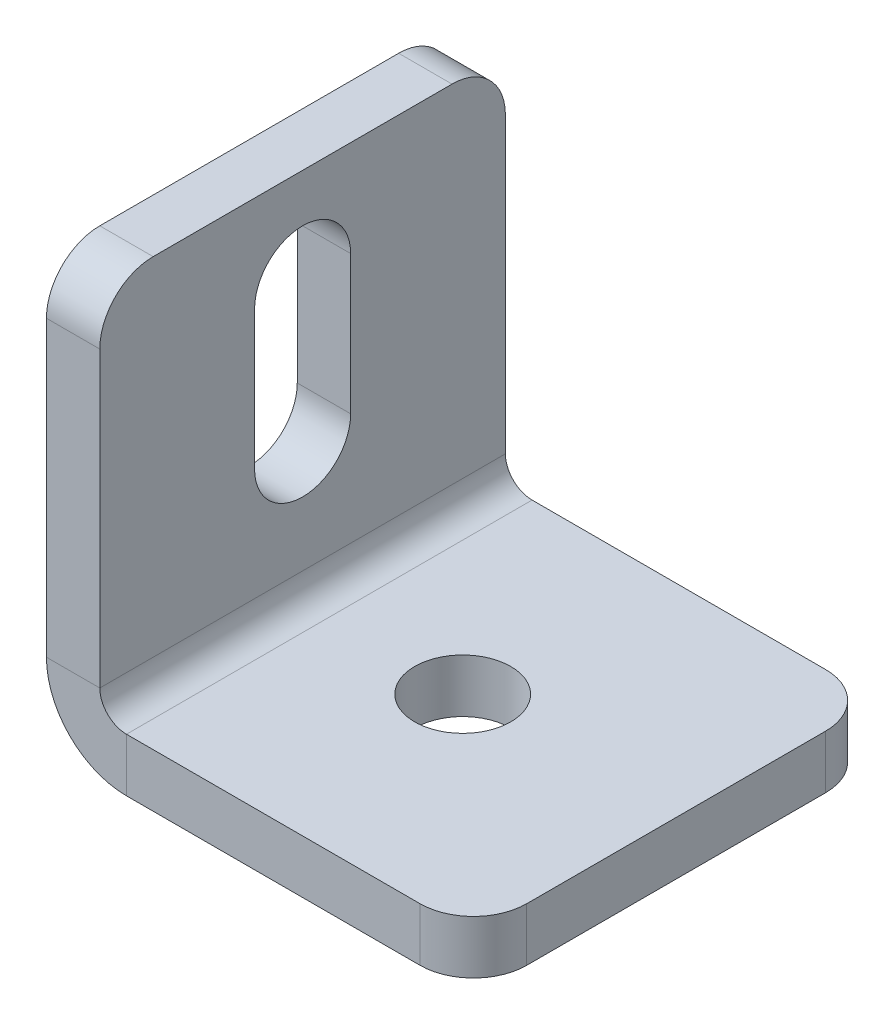
ISO-10303-21;
HEADER;
FILE_DESCRIPTION(('STEP AP214'),'2;1');
FILE_NAME('part.step','',(''),(''),'','','');
FILE_SCHEMA(('AUTOMOTIVE_DESIGN { 1 0 10303 214 1 1 1 1 }'));
ENDSEC;
DATA;
#1=APPLICATION_CONTEXT('core data for automotive mechanical design processes');
#2=APPLICATION_PROTOCOL_DEFINITION('international standard','automotive_design',2000,#1);
#3=PRODUCT_CONTEXT('',#1,'mechanical');
#4=PRODUCT('Part','Part','',(#3));
#5=PRODUCT_RELATED_PRODUCT_CATEGORY('part','',(#4));
#6=PRODUCT_DEFINITION_FORMATION('','',#4);
#7=PRODUCT_DEFINITION_CONTEXT('part definition',#1,'design');
#8=PRODUCT_DEFINITION('design','',#6,#7);
#9=PRODUCT_DEFINITION_SHAPE('','',#8);
#10=(LENGTH_UNIT() NAMED_UNIT(*) SI_UNIT(.MILLI.,.METRE.));
#11=(NAMED_UNIT(*) PLANE_ANGLE_UNIT() SI_UNIT($,.RADIAN.));
#12=(NAMED_UNIT(*) SI_UNIT($,.STERADIAN.) SOLID_ANGLE_UNIT());
#13=UNCERTAINTY_MEASURE_WITH_UNIT(LENGTH_MEASURE(1.E-05),#10,'distance_accuracy_value','');
#14=(GEOMETRIC_REPRESENTATION_CONTEXT(3) GLOBAL_UNCERTAINTY_ASSIGNED_CONTEXT((#13)) GLOBAL_UNIT_ASSIGNED_CONTEXT((#10,
#11,#12)) REPRESENTATION_CONTEXT('',''));
#15=CARTESIAN_POINT('',(0.,0.,0.));
#16=DIRECTION('',(0.,0.,1.));
#17=DIRECTION('',(1.,0.,0.));
#18=AXIS2_PLACEMENT_3D('',#15,#16,#17);
#19=CARTESIAN_POINT('',(0.,18.,0.));
#20=DIRECTION('',(-1.,0.,0.));
#21=DIRECTION('',(0.,0.,1.));
#22=AXIS2_PLACEMENT_3D('',#19,#20,#21);
#23=CYLINDRICAL_SURFACE('',#22,4.5);
#24=CARTESIAN_POINT('',(5.,18.,0.));
#25=DIRECTION('',(1.,0.,0.));
#26=DIRECTION('',(0.,0.,-1.));
#27=AXIS2_PLACEMENT_3D('',#24,#25,#26);
#28=CIRCLE('',#27,4.5);
#29=CARTESIAN_POINT('',(5.,18.,4.5));
#30=VERTEX_POINT('',#29);
#31=CARTESIAN_POINT('',(5.,18.,-4.5));
#32=VERTEX_POINT('',#31);
#33=EDGE_CURVE('E283',#30,#32,#28,.T.);
#34=ORIENTED_EDGE('',*,*,#33,.T.);
#35=DIRECTION('',(1.,0.,0.));
#36=VECTOR('',#35,1.);
#37=CARTESIAN_POINT('',(0.,18.,-4.5));
#38=LINE('',#37,#36);
#39=CARTESIAN_POINT('',(0.,18.,-4.5));
#40=VERTEX_POINT('',#39);
#41=EDGE_CURVE('E203',#40,#32,#38,.T.);
#42=ORIENTED_EDGE('',*,*,#41,.F.);
#43=CARTESIAN_POINT('',(0.,18.,0.));
#44=DIRECTION('',(1.,0.,0.));
#45=DIRECTION('',(0.,0.,-1.));
#46=AXIS2_PLACEMENT_3D('',#43,#44,#45);
#47=CIRCLE('',#46,4.5);
#48=CARTESIAN_POINT('',(0.,18.,4.5));
#49=VERTEX_POINT('',#48);
#50=EDGE_CURVE('E208',#49,#40,#47,.T.);
#51=ORIENTED_EDGE('',*,*,#50,.F.);
#52=DIRECTION('',(1.,0.,0.));
#53=VECTOR('',#52,1.);
#54=CARTESIAN_POINT('',(0.,18.,4.5));
#55=LINE('',#54,#53);
#56=EDGE_CURVE('E170',#49,#30,#55,.T.);
#57=ORIENTED_EDGE('',*,*,#56,.T.);
#58=EDGE_LOOP('',(#34,#42,#51,#57));
#59=FACE_BOUND('',#58,.T.);
#60=ADVANCED_FACE('F48',(#59),#23,.F.);
#61=CARTESIAN_POINT('',(0.,0.,19.));
#62=DIRECTION('',(0.,0.,-1.));
#63=DIRECTION('',(0.,-1.,0.));
#64=AXIS2_PLACEMENT_3D('',#61,#62,#63);
#65=PLANE('',#64);
#66=DIRECTION('',(0.,1.,0.));
#67=VECTOR('',#66,1.);
#68=CARTESIAN_POINT('',(5.,0.,19.));
#69=LINE('',#68,#67);
#70=CARTESIAN_POINT('',(5.,35.,19.));
#71=VERTEX_POINT('',#70);
#72=CARTESIAN_POINT('',(5.,7.5,19.));
#73=VERTEX_POINT('',#72);
#74=EDGE_CURVE('E289',#71,#73,#69,.F.);
#75=ORIENTED_EDGE('',*,*,#74,.F.);
#76=DIRECTION('',(1.,0.,0.));
#77=VECTOR('',#76,1.);
#78=CARTESIAN_POINT('',(0.,35.,19.));
#79=LINE('',#78,#77);
#80=CARTESIAN_POINT('',(0.,35.,19.));
#81=VERTEX_POINT('',#80);
#82=EDGE_CURVE('E11',#71,#81,#79,.F.);
#83=ORIENTED_EDGE('',*,*,#82,.T.);
#84=DIRECTION('',(0.,-1.,0.));
#85=VECTOR('',#84,1.);
#86=CARTESIAN_POINT('',(0.,0.,19.));
#87=LINE('',#86,#85);
#88=CARTESIAN_POINT('',(0.,7.5,19.));
#89=VERTEX_POINT('',#88);
#90=EDGE_CURVE('E211',#81,#89,#87,.T.);
#91=ORIENTED_EDGE('',*,*,#90,.T.);
#92=DIRECTION('',(-1.,0.,0.));
#93=VECTOR('',#92,1.);
#94=CARTESIAN_POINT('',(0.,7.5,19.));
#95=LINE('',#94,#93);
#96=EDGE_CURVE('E305',#73,#89,#95,.T.);
#97=ORIENTED_EDGE('',*,*,#96,.F.);
#98=EDGE_LOOP('',(#75,#83,#91,#97));
#99=FACE_BOUND('',#98,.T.);
#100=ADVANCED_FACE('F385',(#99),#65,.F.);
#101=CARTESIAN_POINT('',(0.,40.,-19.));
#102=DIRECTION('',(0.,-1.,0.));
#103=DIRECTION('',(0.,0.,1.));
#104=AXIS2_PLACEMENT_3D('',#101,#102,#103);
#105=PLANE('',#104);
#106=DIRECTION('',(0.,0.,1.));
#107=VECTOR('',#106,1.);
#108=CARTESIAN_POINT('',(5.,40.,-19.));
#109=LINE('',#108,#107);
#110=CARTESIAN_POINT('',(5.,40.,-14.));
#111=VERTEX_POINT('',#110);
#112=CARTESIAN_POINT('',(5.,40.,14.));
#113=VERTEX_POINT('',#112);
#114=EDGE_CURVE('E286',#111,#113,#109,.T.);
#115=ORIENTED_EDGE('',*,*,#114,.F.);
#116=DIRECTION('',(-1.,0.,0.));
#117=VECTOR('',#116,1.);
#118=CARTESIAN_POINT('',(0.,40.,-14.));
#119=LINE('',#118,#117);
#120=CARTESIAN_POINT('',(0.,40.,-14.));
#121=VERTEX_POINT('',#120);
#122=EDGE_CURVE('E340',#111,#121,#119,.T.);
#123=ORIENTED_EDGE('',*,*,#122,.T.);
#124=DIRECTION('',(0.,0.,1.));
#125=VECTOR('',#124,1.);
#126=CARTESIAN_POINT('',(0.,40.,-19.));
#127=LINE('',#126,#125);
#128=CARTESIAN_POINT('',(0.,40.,14.));
#129=VERTEX_POINT('',#128);
#130=EDGE_CURVE('E215',#121,#129,#127,.T.);
#131=ORIENTED_EDGE('',*,*,#130,.T.);
#132=DIRECTION('',(1.,0.,0.));
#133=VECTOR('',#132,1.);
#134=CARTESIAN_POINT('',(0.,40.,14.));
#135=LINE('',#134,#133);
#136=EDGE_CURVE('E337',#129,#113,#135,.T.);
#137=ORIENTED_EDGE('',*,*,#136,.T.);
#138=EDGE_LOOP('',(#115,#123,#131,#137));
#139=FACE_BOUND('',#138,.T.);
#140=ADVANCED_FACE('F365',(#139),#105,.F.);
#141=CARTESIAN_POINT('',(0.,0.,-19.));
#142=DIRECTION('',(0.,0.,-1.));
#143=DIRECTION('',(0.,-1.,0.));
#144=AXIS2_PLACEMENT_3D('',#141,#142,#143);
#145=PLANE('',#144);
#146=DIRECTION('',(0.,-1.,0.));
#147=VECTOR('',#146,1.);
#148=CARTESIAN_POINT('',(0.,0.,-19.));
#149=LINE('',#148,#147);
#150=CARTESIAN_POINT('',(0.,35.,-19.));
#151=VERTEX_POINT('',#150);
#152=CARTESIAN_POINT('',(0.,7.5,-19.));
#153=VERTEX_POINT('',#152);
#154=EDGE_CURVE('E219',#151,#153,#149,.T.);
#155=ORIENTED_EDGE('',*,*,#154,.F.);
#156=DIRECTION('',(1.,0.,0.));
#157=VECTOR('',#156,1.);
#158=CARTESIAN_POINT('',(0.,35.,-19.));
#159=LINE('',#158,#157);
#160=CARTESIAN_POINT('',(5.,35.,-19.));
#161=VERTEX_POINT('',#160);
#162=EDGE_CURVE('E350',#151,#161,#159,.T.);
#163=ORIENTED_EDGE('',*,*,#162,.T.);
#164=DIRECTION('',(0.,1.,0.));
#165=VECTOR('',#164,1.);
#166=CARTESIAN_POINT('',(5.,0.,-19.));
#167=LINE('',#166,#165);
#168=CARTESIAN_POINT('',(5.,7.5,-19.));
#169=VERTEX_POINT('',#168);
#170=EDGE_CURVE('E268',#161,#169,#167,.F.);
#171=ORIENTED_EDGE('',*,*,#170,.T.);
#172=DIRECTION('',(-1.,0.,0.));
#173=VECTOR('',#172,1.);
#174=CARTESIAN_POINT('',(0.,7.5,-19.));
#175=LINE('',#174,#173);
#176=EDGE_CURVE('E301',#169,#153,#175,.T.);
#177=ORIENTED_EDGE('',*,*,#176,.T.);
#178=EDGE_LOOP('',(#155,#163,#171,#177));
#179=FACE_BOUND('',#178,.T.);
#180=ADVANCED_FACE('F371',(#179),#145,.T.);
#181=CARTESIAN_POINT('',(7.5,7.5,-19.));
#182=DIRECTION('',(0.,0.,1.));
#183=DIRECTION('',(1.,0.,0.));
#184=AXIS2_PLACEMENT_3D('',#181,#182,#183);
#185=PLANE('',#184);
#186=ORIENTED_EDGE('',*,*,#176,.F.);
#187=CARTESIAN_POINT('',(7.5,7.5,-19.));
#188=DIRECTION('',(0.,0.,1.));
#189=DIRECTION('',(1.,0.,0.));
#190=AXIS2_PLACEMENT_3D('',#187,#188,#189);
#191=CIRCLE('',#190,2.5);
#192=CARTESIAN_POINT('',(7.5,5.,-19.));
#193=VERTEX_POINT('',#192);
#194=EDGE_CURVE('E279',#169,#193,#191,.T.);
#195=ORIENTED_EDGE('',*,*,#194,.T.);
#196=DIRECTION('',(0.,-1.,0.));
#197=VECTOR('',#196,1.);
#198=CARTESIAN_POINT('',(7.5,0.,-19.));
#199=LINE('',#198,#197);
#200=CARTESIAN_POINT('',(7.5,0.,-19.));
#201=VERTEX_POINT('',#200);
#202=EDGE_CURVE('E298',#193,#201,#199,.T.);
#203=ORIENTED_EDGE('',*,*,#202,.T.);
#204=CARTESIAN_POINT('',(7.5,7.5,-19.));
#205=DIRECTION('',(0.,0.,-1.));
#206=DIRECTION('',(-1.,0.,0.));
#207=AXIS2_PLACEMENT_3D('',#204,#205,#206);
#208=CIRCLE('',#207,7.5);
#209=EDGE_CURVE('E212',#153,#201,#208,.F.);
#210=ORIENTED_EDGE('',*,*,#209,.F.);
#211=EDGE_LOOP('',(#186,#195,#203,#210));
#212=FACE_BOUND('',#211,.T.);
#213=ADVANCED_FACE('F376',(#212),#185,.F.);
#214=CARTESIAN_POINT('',(40.,0.,-19.));
#215=DIRECTION('',(0.,0.,-1.));
#216=DIRECTION('',(1.,0.,0.));
#217=AXIS2_PLACEMENT_3D('',#214,#215,#216);
#218=PLANE('',#217);
#219=DIRECTION('',(1.,0.,0.));
#220=VECTOR('',#219,1.);
#221=CARTESIAN_POINT('',(40.,5.,-19.));
#222=LINE('',#221,#220);
#223=CARTESIAN_POINT('',(35.,5.,-19.));
#224=VERTEX_POINT('',#223);
#225=EDGE_CURVE('E262',#193,#224,#222,.T.);
#226=ORIENTED_EDGE('',*,*,#225,.T.);
#227=DIRECTION('',(0.,-1.,0.));
#228=VECTOR('',#227,1.);
#229=CARTESIAN_POINT('',(35.,0.,-19.));
#230=LINE('',#229,#228);
#231=CARTESIAN_POINT('',(35.,0.,-19.));
#232=VERTEX_POINT('',#231);
#233=EDGE_CURVE('E309',#224,#232,#230,.T.);
#234=ORIENTED_EDGE('',*,*,#233,.T.);
#235=DIRECTION('',(1.,0.,0.));
#236=VECTOR('',#235,1.);
#237=CARTESIAN_POINT('',(40.,0.,-19.));
#238=LINE('',#237,#236);
#239=EDGE_CURVE('E234',#201,#232,#238,.T.);
#240=ORIENTED_EDGE('',*,*,#239,.F.);
#241=ORIENTED_EDGE('',*,*,#202,.F.);
#242=EDGE_LOOP('',(#226,#234,#240,#241));
#243=FACE_BOUND('',#242,.T.);
#244=ADVANCED_FACE('F418',(#243),#218,.T.);
#245=CARTESIAN_POINT('',(40.,0.,-19.));
#246=DIRECTION('',(1.,0.,0.));
#247=DIRECTION('',(0.,0.,1.));
#248=AXIS2_PLACEMENT_3D('',#245,#246,#247);
#249=PLANE('',#248);
#250=DIRECTION('',(0.,0.,1.));
#251=VECTOR('',#250,1.);
#252=CARTESIAN_POINT('',(40.,0.,-19.));
#253=LINE('',#252,#251);
#254=CARTESIAN_POINT('',(40.,0.,-14.));
#255=VERTEX_POINT('',#254);
#256=CARTESIAN_POINT('',(40.,0.,14.));
#257=VERTEX_POINT('',#256);
#258=EDGE_CURVE('E226',#255,#257,#253,.T.);
#259=ORIENTED_EDGE('',*,*,#258,.F.);
#260=DIRECTION('',(0.,-1.,0.));
#261=VECTOR('',#260,1.);
#262=CARTESIAN_POINT('',(40.,0.,-14.));
#263=LINE('',#262,#261);
#264=CARTESIAN_POINT('',(40.,5.,-14.));
#265=VERTEX_POINT('',#264);
#266=EDGE_CURVE('E325',#255,#265,#263,.F.);
#267=ORIENTED_EDGE('',*,*,#266,.T.);
#268=DIRECTION('',(0.,0.,1.));
#269=VECTOR('',#268,1.);
#270=CARTESIAN_POINT('',(40.,5.,-19.));
#271=LINE('',#270,#269);
#272=CARTESIAN_POINT('',(40.,5.,14.));
#273=VERTEX_POINT('',#272);
#274=EDGE_CURVE('E267',#265,#273,#271,.T.);
#275=ORIENTED_EDGE('',*,*,#274,.T.);
#276=DIRECTION('',(0.,1.,0.));
#277=VECTOR('',#276,1.);
#278=CARTESIAN_POINT('',(40.,0.,14.));
#279=LINE('',#278,#277);
#280=EDGE_CURVE('E321',#273,#257,#279,.F.);
#281=ORIENTED_EDGE('',*,*,#280,.T.);
#282=EDGE_LOOP('',(#259,#267,#275,#281));
#283=FACE_BOUND('',#282,.T.);
#284=ADVANCED_FACE('F409',(#283),#249,.T.);
#285=CARTESIAN_POINT('',(40.,0.,19.));
#286=DIRECTION('',(0.,0.,-1.));
#287=DIRECTION('',(1.,0.,0.));
#288=AXIS2_PLACEMENT_3D('',#285,#286,#287);
#289=PLANE('',#288);
#290=DIRECTION('',(1.,0.,0.));
#291=VECTOR('',#290,1.);
#292=CARTESIAN_POINT('',(40.,0.,19.));
#293=LINE('',#292,#291);
#294=CARTESIAN_POINT('',(7.5,0.,19.));
#295=VERTEX_POINT('',#294);
#296=CARTESIAN_POINT('',(35.,0.,19.));
#297=VERTEX_POINT('',#296);
#298=EDGE_CURVE('E230',#295,#297,#293,.T.);
#299=ORIENTED_EDGE('',*,*,#298,.T.);
#300=DIRECTION('',(0.,-1.,0.));
#301=VECTOR('',#300,1.);
#302=CARTESIAN_POINT('',(35.,0.,19.));
#303=LINE('',#302,#301);
#304=CARTESIAN_POINT('',(35.,5.,19.));
#305=VERTEX_POINT('',#304);
#306=EDGE_CURVE('E334',#297,#305,#303,.F.);
#307=ORIENTED_EDGE('',*,*,#306,.T.);
#308=DIRECTION('',(1.,0.,0.));
#309=VECTOR('',#308,1.);
#310=CARTESIAN_POINT('',(40.,5.,19.));
#311=LINE('',#310,#309);
#312=CARTESIAN_POINT('',(7.5,5.,19.));
#313=VERTEX_POINT('',#312);
#314=EDGE_CURVE('E269',#313,#305,#311,.T.);
#315=ORIENTED_EDGE('',*,*,#314,.F.);
#316=DIRECTION('',(0.,-1.,0.));
#317=VECTOR('',#316,1.);
#318=CARTESIAN_POINT('',(7.5,0.,19.));
#319=LINE('',#318,#317);
#320=EDGE_CURVE('E246',#313,#295,#319,.T.);
#321=ORIENTED_EDGE('',*,*,#320,.T.);
#322=EDGE_LOOP('',(#299,#307,#315,#321));
#323=FACE_BOUND('',#322,.T.);
#324=ADVANCED_FACE('F396',(#323),#289,.F.);
#325=CARTESIAN_POINT('',(20.,0.,0.));
#326=DIRECTION('',(0.,-1.,0.));
#327=DIRECTION('',(1.,0.,0.));
#328=AXIS2_PLACEMENT_3D('',#325,#326,#327);
#329=CYLINDRICAL_SURFACE('',#328,4.5);
#330=CARTESIAN_POINT('',(20.,0.,0.));
#331=DIRECTION('',(0.,-1.,0.));
#332=DIRECTION('',(0.,0.,-1.));
#333=AXIS2_PLACEMENT_3D('',#330,#331,#332);
#334=CIRCLE('',#333,4.5);
#335=CARTESIAN_POINT('',(20.,0.,-4.49999999999999));
#336=VERTEX_POINT('',#335);
#337=EDGE_CURVE('E222',#336,#336,#334,.T.);
#338=ORIENTED_EDGE('',*,*,#337,.T.);
#339=EDGE_LOOP('',(#338));
#340=FACE_BOUND('',#339,.T.);
#341=CARTESIAN_POINT('',(20.,5.,0.));
#342=DIRECTION('',(0.,-1.,0.));
#343=DIRECTION('',(0.,0.,-1.));
#344=AXIS2_PLACEMENT_3D('',#341,#342,#343);
#345=CIRCLE('',#344,4.5);
#346=CARTESIAN_POINT('',(20.,5.,-4.49999999999999));
#347=VERTEX_POINT('',#346);
#348=EDGE_CURVE('E263',#347,#347,#345,.T.);
#349=ORIENTED_EDGE('',*,*,#348,.F.);
#350=EDGE_LOOP('',(#349));
#351=FACE_BOUND('',#350,.T.);
#352=ADVANCED_FACE('F471',(#340,#351),#329,.F.);
#353=CARTESIAN_POINT('',(7.5,7.5,19.));
#354=DIRECTION('',(0.,0.,-1.));
#355=DIRECTION('',(-1.,0.,0.));
#356=AXIS2_PLACEMENT_3D('',#353,#354,#355);
#357=PLANE('',#356);
#358=CARTESIAN_POINT('',(7.5,7.5,19.));
#359=DIRECTION('',(0.,0.,1.));
#360=DIRECTION('',(1.,0.,0.));
#361=AXIS2_PLACEMENT_3D('',#358,#359,#360);
#362=CIRCLE('',#361,2.5);
#363=EDGE_CURVE('E202',#313,#73,#362,.F.);
#364=ORIENTED_EDGE('',*,*,#363,.T.);
#365=ORIENTED_EDGE('',*,*,#96,.T.);
#366=CARTESIAN_POINT('',(7.5,7.5,19.));
#367=DIRECTION('',(0.,0.,1.));
#368=DIRECTION('',(1.,0.,0.));
#369=AXIS2_PLACEMENT_3D('',#366,#367,#368);
#370=CIRCLE('',#369,7.5);
#371=EDGE_CURVE('E247',#295,#89,#370,.F.);
#372=ORIENTED_EDGE('',*,*,#371,.F.);
#373=ORIENTED_EDGE('',*,*,#320,.F.);
#374=EDGE_LOOP('',(#364,#365,#372,#373));
#375=FACE_BOUND('',#374,.T.);
#376=ADVANCED_FACE('F388',(#375),#357,.F.);
#377=CARTESIAN_POINT('',(40.,0.,-19.));
#378=DIRECTION('',(0.,-1.,0.));
#379=DIRECTION('',(1.,0.,0.));
#380=AXIS2_PLACEMENT_3D('',#377,#378,#379);
#381=PLANE('',#380);
#382=ORIENTED_EDGE('',*,*,#337,.F.);
#383=EDGE_LOOP('',(#382));
#384=FACE_BOUND('',#383,.T.);
#385=ORIENTED_EDGE('',*,*,#239,.T.);
#386=CARTESIAN_POINT('',(35.,0.,-14.));
#387=DIRECTION('',(0.,-1.,0.));
#388=DIRECTION('',(1.,0.,0.));
#389=AXIS2_PLACEMENT_3D('',#386,#387,#388);
#390=CIRCLE('',#389,5.);
#391=EDGE_CURVE('E318',#232,#255,#390,.T.);
#392=ORIENTED_EDGE('',*,*,#391,.T.);
#393=ORIENTED_EDGE('',*,*,#258,.T.);
#394=CARTESIAN_POINT('',(35.,0.,14.));
#395=DIRECTION('',(0.,-1.,0.));
#396=DIRECTION('',(1.,0.,0.));
#397=AXIS2_PLACEMENT_3D('',#394,#395,#396);
#398=CIRCLE('',#397,5.);
#399=EDGE_CURVE('E315',#257,#297,#398,.T.);
#400=ORIENTED_EDGE('',*,*,#399,.T.);
#401=ORIENTED_EDGE('',*,*,#298,.F.);
#402=DIRECTION('',(0.,0.,1.));
#403=VECTOR('',#402,1.);
#404=CARTESIAN_POINT('',(7.5,0.,-19.));
#405=LINE('',#404,#403);
#406=EDGE_CURVE('E242',#295,#201,#405,.F.);
#407=ORIENTED_EDGE('',*,*,#406,.T.);
#408=EDGE_LOOP('',(#385,#392,#393,#400,#401,#407));
#409=FACE_BOUND('',#408,.T.);
#410=ADVANCED_FACE('F412',(#384,#409),#381,.T.);
#411=CARTESIAN_POINT('',(0.,0.,-19.));
#412=DIRECTION('',(-1.,0.,0.));
#413=DIRECTION('',(0.,0.,1.));
#414=AXIS2_PLACEMENT_3D('',#411,#412,#413);
#415=PLANE('',#414);
#416=DIRECTION('',(0.,1.,0.));
#417=VECTOR('',#416,1.);
#418=CARTESIAN_POINT('',(0.,31.,-4.5));
#419=LINE('',#418,#417);
#420=CARTESIAN_POINT('',(0.,31.,-4.5));
#421=VERTEX_POINT('',#420);
#422=EDGE_CURVE('E171',#40,#421,#419,.T.);
#423=ORIENTED_EDGE('',*,*,#422,.T.);
#424=CARTESIAN_POINT('',(0.,31.,0.));
#425=DIRECTION('',(1.,0.,0.));
#426=DIRECTION('',(0.,0.,-1.));
#427=AXIS2_PLACEMENT_3D('',#424,#425,#426);
#428=CIRCLE('',#427,4.5);
#429=CARTESIAN_POINT('',(0.,31.,4.5));
#430=VERTEX_POINT('',#429);
#431=EDGE_CURVE('E165',#421,#430,#428,.T.);
#432=ORIENTED_EDGE('',*,*,#431,.T.);
#433=DIRECTION('',(0.,-1.,0.));
#434=VECTOR('',#433,1.);
#435=CARTESIAN_POINT('',(0.,31.,4.5));
#436=LINE('',#435,#434);
#437=EDGE_CURVE('E174',#430,#49,#436,.T.);
#438=ORIENTED_EDGE('',*,*,#437,.T.);
#439=ORIENTED_EDGE('',*,*,#50,.T.);
#440=EDGE_LOOP('',(#423,#432,#438,#439));
#441=FACE_BOUND('',#440,.T.);
#442=ORIENTED_EDGE('',*,*,#130,.F.);
#443=CARTESIAN_POINT('',(0.,35.,-14.));
#444=DIRECTION('',(-1.,0.,0.));
#445=DIRECTION('',(0.,0.,1.));
#446=AXIS2_PLACEMENT_3D('',#443,#444,#445);
#447=CIRCLE('',#446,5.);
#448=EDGE_CURVE('E347',#121,#151,#447,.T.);
#449=ORIENTED_EDGE('',*,*,#448,.T.);
#450=ORIENTED_EDGE('',*,*,#154,.T.);
#451=DIRECTION('',(0.,0.,1.));
#452=VECTOR('',#451,1.);
#453=CARTESIAN_POINT('',(0.,7.5,-19.));
#454=LINE('',#453,#452);
#455=EDGE_CURVE('E238',#153,#89,#454,.T.);
#456=ORIENTED_EDGE('',*,*,#455,.T.);
#457=ORIENTED_EDGE('',*,*,#90,.F.);
#458=CARTESIAN_POINT('',(0.,35.,14.));
#459=DIRECTION('',(-1.,0.,0.));
#460=DIRECTION('',(0.,0.,1.));
#461=AXIS2_PLACEMENT_3D('',#458,#459,#460);
#462=CIRCLE('',#461,5.);
#463=EDGE_CURVE('E344',#81,#129,#462,.T.);
#464=ORIENTED_EDGE('',*,*,#463,.T.);
#465=EDGE_LOOP('',(#442,#449,#450,#456,#457,#464));
#466=FACE_BOUND('',#465,.T.);
#467=ADVANCED_FACE('F182',(#441,#466),#415,.T.);
#468=CARTESIAN_POINT('',(7.5,7.5,-19.));
#469=DIRECTION('',(0.,0.,1.));
#470=DIRECTION('',(1.,0.,0.));
#471=AXIS2_PLACEMENT_3D('',#468,#469,#470);
#472=CYLINDRICAL_SURFACE('',#471,7.5);
#473=ORIENTED_EDGE('',*,*,#209,.T.);
#474=ORIENTED_EDGE('',*,*,#406,.F.);
#475=ORIENTED_EDGE('',*,*,#371,.T.);
#476=ORIENTED_EDGE('',*,*,#455,.F.);
#477=EDGE_LOOP('',(#473,#474,#475,#476));
#478=FACE_BOUND('',#477,.T.);
#479=ADVANCED_FACE('F380',(#478),#472,.T.);
#480=CARTESIAN_POINT('',(40.,5.,-19.));
#481=DIRECTION('',(0.,-1.,0.));
#482=DIRECTION('',(1.,0.,0.));
#483=AXIS2_PLACEMENT_3D('',#480,#481,#482);
#484=PLANE('',#483);
#485=ORIENTED_EDGE('',*,*,#348,.T.);
#486=EDGE_LOOP('',(#485));
#487=FACE_BOUND('',#486,.T.);
#488=ORIENTED_EDGE('',*,*,#274,.F.);
#489=CARTESIAN_POINT('',(35.,5.,-14.));
#490=DIRECTION('',(0.,-1.,0.));
#491=DIRECTION('',(1.,0.,0.));
#492=AXIS2_PLACEMENT_3D('',#489,#490,#491);
#493=CIRCLE('',#492,5.);
#494=EDGE_CURVE('E331',#265,#224,#493,.F.);
#495=ORIENTED_EDGE('',*,*,#494,.T.);
#496=ORIENTED_EDGE('',*,*,#225,.F.);
#497=DIRECTION('',(0.,0.,1.));
#498=VECTOR('',#497,1.);
#499=CARTESIAN_POINT('',(7.5,5.,-19.));
#500=LINE('',#499,#498);
#501=EDGE_CURVE('E251',#313,#193,#500,.F.);
#502=ORIENTED_EDGE('',*,*,#501,.F.);
#503=ORIENTED_EDGE('',*,*,#314,.T.);
#504=CARTESIAN_POINT('',(35.,5.,14.));
#505=DIRECTION('',(0.,-1.,0.));
#506=DIRECTION('',(1.,0.,0.));
#507=AXIS2_PLACEMENT_3D('',#504,#505,#506);
#508=CIRCLE('',#507,5.);
#509=EDGE_CURVE('E328',#305,#273,#508,.F.);
#510=ORIENTED_EDGE('',*,*,#509,.T.);
#511=EDGE_LOOP('',(#488,#495,#496,#502,#503,#510));
#512=FACE_BOUND('',#511,.T.);
#513=ADVANCED_FACE('F402',(#487,#512),#484,.F.);
#514=CARTESIAN_POINT('',(5.,0.,-19.));
#515=DIRECTION('',(-1.,0.,0.));
#516=DIRECTION('',(0.,0.,1.));
#517=AXIS2_PLACEMENT_3D('',#514,#515,#516);
#518=PLANE('',#517);
#519=CARTESIAN_POINT('',(5.,31.,0.));
#520=DIRECTION('',(1.,0.,0.));
#521=DIRECTION('',(0.,0.,-1.));
#522=AXIS2_PLACEMENT_3D('',#519,#520,#521);
#523=CIRCLE('',#522,4.5);
#524=CARTESIAN_POINT('',(5.,31.,-4.5));
#525=VERTEX_POINT('',#524);
#526=CARTESIAN_POINT('',(5.,31.,4.5));
#527=VERTEX_POINT('',#526);
#528=EDGE_CURVE('E64',#525,#527,#523,.T.);
#529=ORIENTED_EDGE('',*,*,#528,.F.);
#530=DIRECTION('',(0.,1.,0.));
#531=VECTOR('',#530,1.);
#532=CARTESIAN_POINT('',(5.,31.,-4.5));
#533=LINE('',#532,#531);
#534=EDGE_CURVE('E185',#32,#525,#533,.T.);
#535=ORIENTED_EDGE('',*,*,#534,.F.);
#536=ORIENTED_EDGE('',*,*,#33,.F.);
#537=DIRECTION('',(0.,-1.,0.));
#538=VECTOR('',#537,1.);
#539=CARTESIAN_POINT('',(5.,31.,4.5));
#540=LINE('',#539,#538);
#541=EDGE_CURVE('E190',#527,#30,#540,.T.);
#542=ORIENTED_EDGE('',*,*,#541,.F.);
#543=EDGE_LOOP('',(#529,#535,#536,#542));
#544=FACE_BOUND('',#543,.T.);
#545=ORIENTED_EDGE('',*,*,#170,.F.);
#546=CARTESIAN_POINT('',(5.,35.,-14.));
#547=DIRECTION('',(-1.,0.,0.));
#548=DIRECTION('',(0.,0.,1.));
#549=AXIS2_PLACEMENT_3D('',#546,#547,#548);
#550=CIRCLE('',#549,5.);
#551=EDGE_CURVE('E57',#161,#111,#550,.F.);
#552=ORIENTED_EDGE('',*,*,#551,.T.);
#553=ORIENTED_EDGE('',*,*,#114,.T.);
#554=CARTESIAN_POINT('',(5.,35.,14.));
#555=DIRECTION('',(-1.,0.,0.));
#556=DIRECTION('',(0.,0.,1.));
#557=AXIS2_PLACEMENT_3D('',#554,#555,#556);
#558=CIRCLE('',#557,5.);
#559=EDGE_CURVE('E72',#113,#71,#558,.F.);
#560=ORIENTED_EDGE('',*,*,#559,.T.);
#561=ORIENTED_EDGE('',*,*,#74,.T.);
#562=DIRECTION('',(0.,0.,1.));
#563=VECTOR('',#562,1.);
#564=CARTESIAN_POINT('',(5.,7.5,-19.));
#565=LINE('',#564,#563);
#566=EDGE_CURVE('E258',#169,#73,#565,.T.);
#567=ORIENTED_EDGE('',*,*,#566,.F.);
#568=EDGE_LOOP('',(#545,#552,#553,#560,#561,#567));
#569=FACE_BOUND('',#568,.T.);
#570=ADVANCED_FACE('F359',(#544,#569),#518,.F.);
#571=CARTESIAN_POINT('',(7.5,7.5,-19.));
#572=DIRECTION('',(0.,0.,1.));
#573=DIRECTION('',(1.,0.,0.));
#574=AXIS2_PLACEMENT_3D('',#571,#572,#573);
#575=CYLINDRICAL_SURFACE('',#574,2.5);
#576=ORIENTED_EDGE('',*,*,#194,.F.);
#577=ORIENTED_EDGE('',*,*,#566,.T.);
#578=ORIENTED_EDGE('',*,*,#363,.F.);
#579=ORIENTED_EDGE('',*,*,#501,.T.);
#580=EDGE_LOOP('',(#576,#577,#578,#579));
#581=FACE_BOUND('',#580,.T.);
#582=ADVANCED_FACE('F394',(#581),#575,.F.);
#583=CARTESIAN_POINT('',(35.,0.,-14.));
#584=DIRECTION('',(0.,-1.,0.));
#585=DIRECTION('',(1.,0.,0.));
#586=AXIS2_PLACEMENT_3D('',#583,#584,#585);
#587=CYLINDRICAL_SURFACE('',#586,5.);
#588=ORIENTED_EDGE('',*,*,#494,.F.);
#589=ORIENTED_EDGE('',*,*,#266,.F.);
#590=ORIENTED_EDGE('',*,*,#391,.F.);
#591=ORIENTED_EDGE('',*,*,#233,.F.);
#592=EDGE_LOOP('',(#588,#589,#590,#591));
#593=FACE_BOUND('',#592,.T.);
#594=ADVANCED_FACE('F416',(#593),#587,.T.);
#595=CARTESIAN_POINT('',(35.,0.,14.));
#596=DIRECTION('',(0.,1.,0.));
#597=DIRECTION('',(-1.,0.,0.));
#598=AXIS2_PLACEMENT_3D('',#595,#596,#597);
#599=CYLINDRICAL_SURFACE('',#598,5.);
#600=ORIENTED_EDGE('',*,*,#509,.F.);
#601=ORIENTED_EDGE('',*,*,#306,.F.);
#602=ORIENTED_EDGE('',*,*,#399,.F.);
#603=ORIENTED_EDGE('',*,*,#280,.F.);
#604=EDGE_LOOP('',(#600,#601,#602,#603));
#605=FACE_BOUND('',#604,.T.);
#606=ADVANCED_FACE('F406',(#605),#599,.T.);
#607=CARTESIAN_POINT('',(0.,35.,-14.));
#608=DIRECTION('',(1.,0.,0.));
#609=DIRECTION('',(0.,0.,-1.));
#610=AXIS2_PLACEMENT_3D('',#607,#608,#609);
#611=CYLINDRICAL_SURFACE('',#610,5.);
#612=ORIENTED_EDGE('',*,*,#551,.F.);
#613=ORIENTED_EDGE('',*,*,#162,.F.);
#614=ORIENTED_EDGE('',*,*,#448,.F.);
#615=ORIENTED_EDGE('',*,*,#122,.F.);
#616=EDGE_LOOP('',(#612,#613,#614,#615));
#617=FACE_BOUND('',#616,.T.);
#618=ADVANCED_FACE('F368',(#617),#611,.T.);
#619=CARTESIAN_POINT('',(0.,35.,14.));
#620=DIRECTION('',(-1.,0.,0.));
#621=DIRECTION('',(0.,0.,1.));
#622=AXIS2_PLACEMENT_3D('',#619,#620,#621);
#623=CYLINDRICAL_SURFACE('',#622,5.);
#624=ORIENTED_EDGE('',*,*,#559,.F.);
#625=ORIENTED_EDGE('',*,*,#136,.F.);
#626=ORIENTED_EDGE('',*,*,#463,.F.);
#627=ORIENTED_EDGE('',*,*,#82,.F.);
#628=EDGE_LOOP('',(#624,#625,#626,#627));
#629=FACE_BOUND('',#628,.T.);
#630=ADVANCED_FACE('F50',(#629),#623,.T.);
#631=CARTESIAN_POINT('',(0.,31.,0.));
#632=DIRECTION('',(1.,0.,0.));
#633=DIRECTION('',(0.,0.,-1.));
#634=AXIS2_PLACEMENT_3D('',#631,#632,#633);
#635=CYLINDRICAL_SURFACE('',#634,4.5);
#636=ORIENTED_EDGE('',*,*,#528,.T.);
#637=DIRECTION('',(1.,0.,0.));
#638=VECTOR('',#637,1.);
#639=CARTESIAN_POINT('',(0.,31.,4.5));
#640=LINE('',#639,#638);
#641=EDGE_CURVE('E161',#430,#527,#640,.T.);
#642=ORIENTED_EDGE('',*,*,#641,.F.);
#643=ORIENTED_EDGE('',*,*,#431,.F.);
#644=DIRECTION('',(1.,0.,0.));
#645=VECTOR('',#644,1.);
#646=CARTESIAN_POINT('',(0.,31.,-4.5));
#647=LINE('',#646,#645);
#648=EDGE_CURVE('E199',#421,#525,#647,.T.);
#649=ORIENTED_EDGE('',*,*,#648,.T.);
#650=EDGE_LOOP('',(#636,#642,#643,#649));
#651=FACE_BOUND('',#650,.T.);
#652=ADVANCED_FACE('F163',(#651),#635,.F.);
#653=CARTESIAN_POINT('',(0.,31.,-4.5));
#654=DIRECTION('',(0.,0.,-1.));
#655=DIRECTION('',(-1.,0.,0.));
#656=AXIS2_PLACEMENT_3D('',#653,#654,#655);
#657=PLANE('',#656);
#658=ORIENTED_EDGE('',*,*,#534,.T.);
#659=ORIENTED_EDGE('',*,*,#648,.F.);
#660=ORIENTED_EDGE('',*,*,#422,.F.);
#661=ORIENTED_EDGE('',*,*,#41,.T.);
#662=EDGE_LOOP('',(#658,#659,#660,#661));
#663=FACE_BOUND('',#662,.T.);
#664=ADVANCED_FACE('F447',(#663),#657,.F.);
#665=CARTESIAN_POINT('',(0.,31.,4.5));
#666=DIRECTION('',(0.,0.,1.));
#667=DIRECTION('',(1.,0.,0.));
#668=AXIS2_PLACEMENT_3D('',#665,#666,#667);
#669=PLANE('',#668);
#670=ORIENTED_EDGE('',*,*,#541,.T.);
#671=ORIENTED_EDGE('',*,*,#56,.F.);
#672=ORIENTED_EDGE('',*,*,#437,.F.);
#673=ORIENTED_EDGE('',*,*,#641,.T.);
#674=EDGE_LOOP('',(#670,#671,#672,#673));
#675=FACE_BOUND('',#674,.T.);
#676=ADVANCED_FACE('F175',(#675),#669,.F.);
#677=CLOSED_SHELL('',(#60,#100,#140,#180,#213,#244,#284,#324,#352,#376,#410,#467,#479,#513,#570,
#582,#594,#606,#618,#630,#652,#664,#676));
#678=MANIFOLD_SOLID_BREP('B2',#677);
#679=ADVANCED_BREP_SHAPE_REPRESENTATION('',(#18,#678),#14);
#680=SHAPE_DEFINITION_REPRESENTATION(#9,#679);
ENDSEC;
END-ISO-10303-21;
